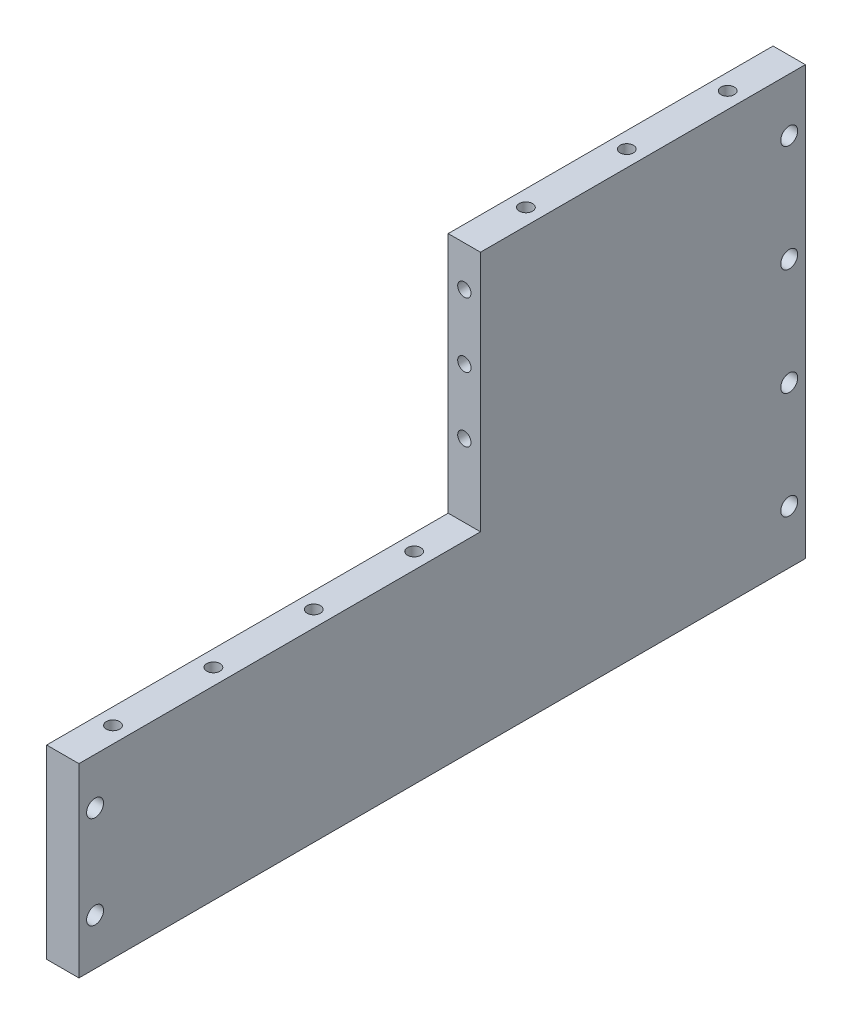
ISO-10303-21;
HEADER;
FILE_DESCRIPTION(('STEP AP214'),'2;1');
FILE_NAME('part.step','',(''),(''),'','','');
FILE_SCHEMA(('AUTOMOTIVE_DESIGN { 1 0 10303 214 1 1 1 1 }'));
ENDSEC;
DATA;
#1=APPLICATION_CONTEXT('core data for automotive mechanical design processes');
#2=APPLICATION_PROTOCOL_DEFINITION('international standard','automotive_design',2000,#1);
#3=PRODUCT_CONTEXT('',#1,'mechanical');
#4=PRODUCT('Part','Part','',(#3));
#5=PRODUCT_RELATED_PRODUCT_CATEGORY('part','',(#4));
#6=PRODUCT_DEFINITION_FORMATION('','',#4);
#7=PRODUCT_DEFINITION_CONTEXT('part definition',#1,'design');
#8=PRODUCT_DEFINITION('design','',#6,#7);
#9=PRODUCT_DEFINITION_SHAPE('','',#8);
#10=(LENGTH_UNIT() NAMED_UNIT(*) SI_UNIT(.MILLI.,.METRE.));
#11=(NAMED_UNIT(*) PLANE_ANGLE_UNIT() SI_UNIT($,.RADIAN.));
#12=(NAMED_UNIT(*) SI_UNIT($,.STERADIAN.) SOLID_ANGLE_UNIT());
#13=UNCERTAINTY_MEASURE_WITH_UNIT(LENGTH_MEASURE(1.E-05),#10,'distance_accuracy_value','');
#14=(GEOMETRIC_REPRESENTATION_CONTEXT(3) GLOBAL_UNCERTAINTY_ASSIGNED_CONTEXT((#13)) GLOBAL_UNIT_ASSIGNED_CONTEXT((#10,
#11,#12)) REPRESENTATION_CONTEXT('',''));
#15=CARTESIAN_POINT('',(0.,0.,0.));
#16=DIRECTION('',(0.,0.,1.));
#17=DIRECTION('',(1.,0.,0.));
#18=AXIS2_PLACEMENT_3D('',#15,#16,#17);
#19=CARTESIAN_POINT('',(-8.,0.,-9.50000000000003));
#20=DIRECTION('',(0.,0.,1.));
#21=DIRECTION('',(0.,-1.,0.));
#22=AXIS2_PLACEMENT_3D('',#19,#20,#21);
#23=PLANE('',#22);
#24=DIRECTION('',(0.,-1.,0.));
#25=VECTOR('',#24,1.);
#26=CARTESIAN_POINT('',(0.,0.,-9.50000000000003));
#27=LINE('',#26,#25);
#28=CARTESIAN_POINT('',(0.,53.,-9.50000000000001));
#29=VERTEX_POINT('',#28);
#30=CARTESIAN_POINT('',(0.,-7.00000000000002,-9.50000000000004));
#31=VERTEX_POINT('',#30);
#32=EDGE_CURVE('E151',#29,#31,#27,.T.);
#33=ORIENTED_EDGE('',*,*,#32,.F.);
#34=DIRECTION('',(1.,0.,0.));
#35=VECTOR('',#34,1.);
#36=CARTESIAN_POINT('',(-8.,53.,-9.50000000000001));
#37=LINE('',#36,#35);
#38=CARTESIAN_POINT('',(-8.,53.,-9.50000000000001));
#39=VERTEX_POINT('',#38);
#40=EDGE_CURVE('E114',#39,#29,#37,.T.);
#41=ORIENTED_EDGE('',*,*,#40,.F.);
#42=DIRECTION('',(0.,-1.,0.));
#43=VECTOR('',#42,1.);
#44=CARTESIAN_POINT('',(-8.,0.,-9.50000000000003));
#45=LINE('',#44,#43);
#46=CARTESIAN_POINT('',(-8.,-7.00000000000002,-9.50000000000004));
#47=VERTEX_POINT('',#46);
#48=EDGE_CURVE('E105',#39,#47,#45,.T.);
#49=ORIENTED_EDGE('',*,*,#48,.T.);
#50=DIRECTION('',(1.,0.,0.));
#51=VECTOR('',#50,1.);
#52=CARTESIAN_POINT('',(-8.,-7.00000000000002,-9.50000000000004));
#53=LINE('',#52,#51);
#54=EDGE_CURVE('E108',#47,#31,#53,.T.);
#55=ORIENTED_EDGE('',*,*,#54,.T.);
#56=EDGE_LOOP('',(#33,#41,#49,#55));
#57=FACE_BOUND('',#56,.T.);
#58=CARTESIAN_POINT('',(-4.,11.,-9.50000000000003));
#59=DIRECTION('',(0.,0.,1.));
#60=DIRECTION('',(1.,0.,0.));
#61=AXIS2_PLACEMENT_3D('',#58,#59,#60);
#62=CIRCLE('',#61,1.65);
#63=CARTESIAN_POINT('',(-2.35,11.,-9.50000000000003));
#64=VERTEX_POINT('',#63);
#65=EDGE_CURVE('E365',#64,#64,#62,.T.);
#66=ORIENTED_EDGE('',*,*,#65,.F.);
#67=EDGE_LOOP('',(#66));
#68=FACE_BOUND('',#67,.T.);
#69=CARTESIAN_POINT('',(-4.,27.,-9.50000000000003));
#70=DIRECTION('',(0.,0.,1.));
#71=DIRECTION('',(1.,0.,0.));
#72=AXIS2_PLACEMENT_3D('',#69,#70,#71);
#73=CIRCLE('',#72,1.65);
#74=CARTESIAN_POINT('',(-2.35,27.,-9.50000000000003));
#75=VERTEX_POINT('',#74);
#76=EDGE_CURVE('E357',#75,#75,#73,.T.);
#77=ORIENTED_EDGE('',*,*,#76,.F.);
#78=EDGE_LOOP('',(#77));
#79=FACE_BOUND('',#78,.T.);
#80=CARTESIAN_POINT('',(-4.,43.,-9.50000000000003));
#81=DIRECTION('',(0.,0.,-1.));
#82=DIRECTION('',(-1.,0.,0.));
#83=AXIS2_PLACEMENT_3D('',#80,#81,#82);
#84=CIRCLE('',#83,1.65);
#85=CARTESIAN_POINT('',(-5.65,43.,-9.50000000000003));
#86=VERTEX_POINT('',#85);
#87=EDGE_CURVE('E351',#86,#86,#84,.T.);
#88=ORIENTED_EDGE('',*,*,#87,.T.);
#89=EDGE_LOOP('',(#88));
#90=FACE_BOUND('',#89,.T.);
#91=ADVANCED_FACE('F40',(#57,#68,#79,#90),#23,.T.);
#92=CARTESIAN_POINT('',(-8.,-53.,0.));
#93=DIRECTION('',(0.,-1.,0.));
#94=DIRECTION('',(0.,0.,-1.));
#95=AXIS2_PLACEMENT_3D('',#92,#93,#94);
#96=PLANE('',#95);
#97=CARTESIAN_POINT('',(-4.,-53.,-4.50000000000003));
#98=DIRECTION('',(0.,1.,0.));
#99=DIRECTION('',(0.,0.,1.));
#100=AXIS2_PLACEMENT_3D('',#97,#98,#99);
#101=CIRCLE('',#100,1.65);
#102=CARTESIAN_POINT('',(-4.,-53.,-2.85000000000003));
#103=VERTEX_POINT('',#102);
#104=EDGE_CURVE('E421',#103,#103,#101,.T.);
#105=ORIENTED_EDGE('',*,*,#104,.T.);
#106=EDGE_LOOP('',(#105));
#107=FACE_BOUND('',#106,.T.);
#108=DIRECTION('',(0.,0.,-1.));
#109=VECTOR('',#108,1.);
#110=CARTESIAN_POINT('',(0.,-53.,0.));
#111=LINE('',#110,#109);
#112=CARTESIAN_POINT('',(0.,-53.,90.));
#113=VERTEX_POINT('',#112);
#114=CARTESIAN_POINT('',(0.,-53.,-90.));
#115=VERTEX_POINT('',#114);
#116=EDGE_CURVE('E142',#113,#115,#111,.T.);
#117=ORIENTED_EDGE('',*,*,#116,.F.);
#118=DIRECTION('',(1.,0.,0.));
#119=VECTOR('',#118,1.);
#120=CARTESIAN_POINT('',(-8.,-53.,90.));
#121=LINE('',#120,#119);
#122=CARTESIAN_POINT('',(-8.,-53.,90.));
#123=VERTEX_POINT('',#122);
#124=EDGE_CURVE('E11',#123,#113,#121,.T.);
#125=ORIENTED_EDGE('',*,*,#124,.F.);
#126=DIRECTION('',(0.,0.,-1.));
#127=VECTOR('',#126,1.);
#128=CARTESIAN_POINT('',(-8.,-53.,0.));
#129=LINE('',#128,#127);
#130=CARTESIAN_POINT('',(-8.,-53.,-90.));
#131=VERTEX_POINT('',#130);
#132=EDGE_CURVE('E174',#123,#131,#129,.T.);
#133=ORIENTED_EDGE('',*,*,#132,.T.);
#134=DIRECTION('',(1.,0.,0.));
#135=VECTOR('',#134,1.);
#136=CARTESIAN_POINT('',(-8.,-53.,-90.));
#137=LINE('',#136,#135);
#138=EDGE_CURVE('E44',#131,#115,#137,.T.);
#139=ORIENTED_EDGE('',*,*,#138,.T.);
#140=EDGE_LOOP('',(#117,#125,#133,#139));
#141=FACE_BOUND('',#140,.T.);
#142=CARTESIAN_POINT('',(-4.,-53.,-45.25));
#143=DIRECTION('',(0.,-1.,0.));
#144=DIRECTION('',(0.,0.,-1.));
#145=AXIS2_PLACEMENT_3D('',#142,#143,#144);
#146=CIRCLE('',#145,1.65);
#147=CARTESIAN_POINT('',(-4.,-53.,-46.9));
#148=VERTEX_POINT('',#147);
#149=EDGE_CURVE('E415',#148,#148,#146,.T.);
#150=ORIENTED_EDGE('',*,*,#149,.F.);
#151=EDGE_LOOP('',(#150));
#152=FACE_BOUND('',#151,.T.);
#153=CARTESIAN_POINT('',(-4.,-53.,-86.));
#154=DIRECTION('',(0.,-1.,0.));
#155=DIRECTION('',(0.,0.,-1.));
#156=AXIS2_PLACEMENT_3D('',#153,#154,#155);
#157=CIRCLE('',#156,1.65);
#158=CARTESIAN_POINT('',(-4.,-53.,-87.65));
#159=VERTEX_POINT('',#158);
#160=EDGE_CURVE('E412',#159,#159,#157,.T.);
#161=ORIENTED_EDGE('',*,*,#160,.F.);
#162=EDGE_LOOP('',(#161));
#163=FACE_BOUND('',#162,.T.);
#164=ADVANCED_FACE('F42',(#107,#141,#152,#163),#96,.T.);
#165=CARTESIAN_POINT('',(-8.,0.,90.));
#166=DIRECTION('',(0.,0.,1.));
#167=DIRECTION('',(1.,0.,0.));
#168=AXIS2_PLACEMENT_3D('',#165,#166,#167);
#169=PLANE('',#168);
#170=DIRECTION('',(0.,-1.,0.));
#171=VECTOR('',#170,1.);
#172=CARTESIAN_POINT('',(0.,0.,90.));
#173=LINE('',#172,#171);
#174=CARTESIAN_POINT('',(0.,-7.00000000000002,90.));
#175=VERTEX_POINT('',#174);
#176=EDGE_CURVE('E154',#175,#113,#173,.T.);
#177=ORIENTED_EDGE('',*,*,#176,.F.);
#178=DIRECTION('',(1.,0.,0.));
#179=VECTOR('',#178,1.);
#180=CARTESIAN_POINT('',(-8.,-7.00000000000002,90.));
#181=LINE('',#180,#179);
#182=CARTESIAN_POINT('',(-8.,-7.00000000000002,90.));
#183=VERTEX_POINT('',#182);
#184=EDGE_CURVE('E50',#183,#175,#181,.T.);
#185=ORIENTED_EDGE('',*,*,#184,.F.);
#186=DIRECTION('',(0.,-1.,0.));
#187=VECTOR('',#186,1.);
#188=CARTESIAN_POINT('',(-8.,0.,90.));
#189=LINE('',#188,#187);
#190=EDGE_CURVE('E106',#183,#123,#189,.T.);
#191=ORIENTED_EDGE('',*,*,#190,.T.);
#192=ORIENTED_EDGE('',*,*,#124,.T.);
#193=EDGE_LOOP('',(#177,#185,#191,#192));
#194=FACE_BOUND('',#193,.T.);
#195=ADVANCED_FACE('F188',(#194),#169,.T.);
#196=CARTESIAN_POINT('',(-8.,-7.00000000000002,0.));
#197=DIRECTION('',(0.,-1.,0.));
#198=DIRECTION('',(0.,0.,-1.));
#199=AXIS2_PLACEMENT_3D('',#196,#197,#198);
#200=PLANE('',#199);
#201=CARTESIAN_POINT('',(-4.,-7.00000000000002,2.93749999999999));
#202=DIRECTION('',(0.,1.,0.));
#203=DIRECTION('',(0.,0.,1.));
#204=AXIS2_PLACEMENT_3D('',#201,#202,#203);
#205=CIRCLE('',#204,1.65);
#206=CARTESIAN_POINT('',(-4.,-7.00000000000002,4.58749999999999));
#207=VERTEX_POINT('',#206);
#208=EDGE_CURVE('E375',#207,#207,#205,.T.);
#209=ORIENTED_EDGE('',*,*,#208,.F.);
#210=EDGE_LOOP('',(#209));
#211=FACE_BOUND('',#210,.T.);
#212=CARTESIAN_POINT('',(-4.,-7.00000000000002,27.8125));
#213=DIRECTION('',(0.,1.,0.));
#214=DIRECTION('',(0.,0.,1.));
#215=AXIS2_PLACEMENT_3D('',#212,#213,#214);
#216=CIRCLE('',#215,1.65);
#217=CARTESIAN_POINT('',(-4.,-7.00000000000002,29.4625));
#218=VERTEX_POINT('',#217);
#219=EDGE_CURVE('E378',#218,#218,#216,.T.);
#220=ORIENTED_EDGE('',*,*,#219,.F.);
#221=EDGE_LOOP('',(#220));
#222=FACE_BOUND('',#221,.T.);
#223=CARTESIAN_POINT('',(-4.,-7.00000000000002,52.6875));
#224=DIRECTION('',(0.,1.,0.));
#225=DIRECTION('',(0.,0.,-1.));
#226=AXIS2_PLACEMENT_3D('',#223,#224,#225);
#227=CIRCLE('',#226,1.65);
#228=CARTESIAN_POINT('',(-4.,-7.00000000000002,51.0375));
#229=VERTEX_POINT('',#228);
#230=EDGE_CURVE('E384',#229,#229,#227,.T.);
#231=ORIENTED_EDGE('',*,*,#230,.F.);
#232=EDGE_LOOP('',(#231));
#233=FACE_BOUND('',#232,.T.);
#234=CARTESIAN_POINT('',(-4.,-7.00000000000002,77.5625));
#235=DIRECTION('',(0.,1.,0.));
#236=DIRECTION('',(0.,0.,-1.));
#237=AXIS2_PLACEMENT_3D('',#234,#235,#236);
#238=CIRCLE('',#237,1.65);
#239=CARTESIAN_POINT('',(-4.,-7.00000000000002,75.9125));
#240=VERTEX_POINT('',#239);
#241=EDGE_CURVE('E354',#240,#240,#238,.T.);
#242=ORIENTED_EDGE('',*,*,#241,.F.);
#243=EDGE_LOOP('',(#242));
#244=FACE_BOUND('',#243,.T.);
#245=DIRECTION('',(0.,0.,-1.));
#246=VECTOR('',#245,1.);
#247=CARTESIAN_POINT('',(0.,-7.00000000000002,0.));
#248=LINE('',#247,#246);
#249=EDGE_CURVE('E110',#175,#31,#248,.T.);
#250=ORIENTED_EDGE('',*,*,#249,.T.);
#251=ORIENTED_EDGE('',*,*,#54,.F.);
#252=DIRECTION('',(0.,0.,-1.));
#253=VECTOR('',#252,1.);
#254=CARTESIAN_POINT('',(-8.,-7.00000000000002,0.));
#255=LINE('',#254,#253);
#256=EDGE_CURVE('E100',#183,#47,#255,.T.);
#257=ORIENTED_EDGE('',*,*,#256,.F.);
#258=ORIENTED_EDGE('',*,*,#184,.T.);
#259=EDGE_LOOP('',(#250,#251,#257,#258));
#260=FACE_BOUND('',#259,.T.);
#261=ADVANCED_FACE('F109',(#211,#222,#233,#244,#260),#200,.F.);
#262=CARTESIAN_POINT('',(-8.,53.,0.));
#263=DIRECTION('',(0.,-1.,0.));
#264=DIRECTION('',(0.,0.,-1.));
#265=AXIS2_PLACEMENT_3D('',#262,#263,#264);
#266=PLANE('',#265);
#267=CARTESIAN_POINT('',(-4.,53.,-24.75));
#268=DIRECTION('',(0.,1.,0.));
#269=DIRECTION('',(0.,0.,-1.));
#270=AXIS2_PLACEMENT_3D('',#267,#268,#269);
#271=CIRCLE('',#270,1.65);
#272=CARTESIAN_POINT('',(-4.,53.,-26.4));
#273=VERTEX_POINT('',#272);
#274=EDGE_CURVE('E399',#273,#273,#271,.T.);
#275=ORIENTED_EDGE('',*,*,#274,.F.);
#276=EDGE_LOOP('',(#275));
#277=FACE_BOUND('',#276,.T.);
#278=CARTESIAN_POINT('',(-4.,53.,-74.75));
#279=DIRECTION('',(0.,1.,0.));
#280=DIRECTION('',(0.,0.,1.));
#281=AXIS2_PLACEMENT_3D('',#278,#279,#280);
#282=CIRCLE('',#281,1.65);
#283=CARTESIAN_POINT('',(-4.,53.,-73.1));
#284=VERTEX_POINT('',#283);
#285=EDGE_CURVE('E392',#284,#284,#282,.T.);
#286=ORIENTED_EDGE('',*,*,#285,.F.);
#287=EDGE_LOOP('',(#286));
#288=FACE_BOUND('',#287,.T.);
#289=CARTESIAN_POINT('',(-4.,53.,-49.75));
#290=DIRECTION('',(0.,1.,0.));
#291=DIRECTION('',(0.,0.,1.));
#292=AXIS2_PLACEMENT_3D('',#289,#290,#291);
#293=CIRCLE('',#292,1.65);
#294=CARTESIAN_POINT('',(-4.,53.,-48.1));
#295=VERTEX_POINT('',#294);
#296=EDGE_CURVE('E395',#295,#295,#293,.T.);
#297=ORIENTED_EDGE('',*,*,#296,.F.);
#298=EDGE_LOOP('',(#297));
#299=FACE_BOUND('',#298,.T.);
#300=DIRECTION('',(0.,0.,-1.));
#301=VECTOR('',#300,1.);
#302=CARTESIAN_POINT('',(0.,53.,0.));
#303=LINE('',#302,#301);
#304=CARTESIAN_POINT('',(0.,53.,-90.));
#305=VERTEX_POINT('',#304);
#306=EDGE_CURVE('E149',#29,#305,#303,.T.);
#307=ORIENTED_EDGE('',*,*,#306,.T.);
#308=DIRECTION('',(1.,0.,0.));
#309=VECTOR('',#308,1.);
#310=CARTESIAN_POINT('',(-8.,53.,-90.));
#311=LINE('',#310,#309);
#312=CARTESIAN_POINT('',(-8.,53.,-90.));
#313=VERTEX_POINT('',#312);
#314=EDGE_CURVE('E177',#313,#305,#311,.T.);
#315=ORIENTED_EDGE('',*,*,#314,.F.);
#316=DIRECTION('',(0.,0.,-1.));
#317=VECTOR('',#316,1.);
#318=CARTESIAN_POINT('',(-8.,53.,0.));
#319=LINE('',#318,#317);
#320=EDGE_CURVE('E118',#39,#313,#319,.T.);
#321=ORIENTED_EDGE('',*,*,#320,.F.);
#322=ORIENTED_EDGE('',*,*,#40,.T.);
#323=EDGE_LOOP('',(#307,#315,#321,#322));
#324=FACE_BOUND('',#323,.T.);
#325=ADVANCED_FACE('F195',(#277,#288,#299,#324),#266,.F.);
#326=CARTESIAN_POINT('',(-8.,39.75,-85.9999999999998));
#327=DIRECTION('',(1.,0.,0.));
#328=DIRECTION('',(0.,0.,-1.));
#329=AXIS2_PLACEMENT_3D('',#326,#327,#328);
#330=CYLINDRICAL_SURFACE('',#329,2.1);
#331=CARTESIAN_POINT('',(-8.,39.75,-85.9999999999998));
#332=DIRECTION('',(1.,0.,0.));
#333=DIRECTION('',(0.,0.,-1.));
#334=AXIS2_PLACEMENT_3D('',#331,#332,#333);
#335=CIRCLE('',#334,2.1);
#336=CARTESIAN_POINT('',(-8.,39.75,-88.0999999999998));
#337=VERTEX_POINT('',#336);
#338=EDGE_CURVE('E136',#337,#337,#335,.T.);
#339=ORIENTED_EDGE('',*,*,#338,.F.);
#340=EDGE_LOOP('',(#339));
#341=FACE_BOUND('',#340,.T.);
#342=CARTESIAN_POINT('',(0.,39.75,-85.9999999999998));
#343=DIRECTION('',(1.,0.,0.));
#344=DIRECTION('',(0.,0.,-1.));
#345=AXIS2_PLACEMENT_3D('',#342,#343,#344);
#346=CIRCLE('',#345,2.1);
#347=CARTESIAN_POINT('',(0.,39.75,-88.0999999999998));
#348=VERTEX_POINT('',#347);
#349=EDGE_CURVE('E169',#348,#348,#346,.T.);
#350=ORIENTED_EDGE('',*,*,#349,.T.);
#351=EDGE_LOOP('',(#350));
#352=FACE_BOUND('',#351,.T.);
#353=ADVANCED_FACE('F206',(#341,#352),#330,.F.);
#354=CARTESIAN_POINT('',(-8.,13.25,-85.9999999999998));
#355=DIRECTION('',(1.,0.,0.));
#356=DIRECTION('',(0.,0.,-1.));
#357=AXIS2_PLACEMENT_3D('',#354,#355,#356);
#358=CYLINDRICAL_SURFACE('',#357,2.1);
#359=CARTESIAN_POINT('',(-8.,13.25,-85.9999999999998));
#360=DIRECTION('',(1.,0.,0.));
#361=DIRECTION('',(0.,0.,-1.));
#362=AXIS2_PLACEMENT_3D('',#359,#360,#361);
#363=CIRCLE('',#362,2.1);
#364=CARTESIAN_POINT('',(-8.,13.25,-88.0999999999998));
#365=VERTEX_POINT('',#364);
#366=EDGE_CURVE('E133',#365,#365,#363,.T.);
#367=ORIENTED_EDGE('',*,*,#366,.F.);
#368=EDGE_LOOP('',(#367));
#369=FACE_BOUND('',#368,.T.);
#370=CARTESIAN_POINT('',(0.,13.25,-85.9999999999998));
#371=DIRECTION('',(1.,0.,0.));
#372=DIRECTION('',(0.,0.,-1.));
#373=AXIS2_PLACEMENT_3D('',#370,#371,#372);
#374=CIRCLE('',#373,2.1);
#375=CARTESIAN_POINT('',(0.,13.25,-88.0999999999998));
#376=VERTEX_POINT('',#375);
#377=EDGE_CURVE('E166',#376,#376,#374,.T.);
#378=ORIENTED_EDGE('',*,*,#377,.T.);
#379=EDGE_LOOP('',(#378));
#380=FACE_BOUND('',#379,.T.);
#381=ADVANCED_FACE('F230',(#369,#380),#358,.F.);
#382=CARTESIAN_POINT('',(-8.,-13.25,-85.9999999999998));
#383=DIRECTION('',(1.,0.,0.));
#384=DIRECTION('',(0.,0.,-1.));
#385=AXIS2_PLACEMENT_3D('',#382,#383,#384);
#386=CYLINDRICAL_SURFACE('',#385,2.1);
#387=CARTESIAN_POINT('',(-8.,-13.25,-85.9999999999998));
#388=DIRECTION('',(1.,0.,0.));
#389=DIRECTION('',(0.,0.,-1.));
#390=AXIS2_PLACEMENT_3D('',#387,#388,#389);
#391=CIRCLE('',#390,2.1);
#392=CARTESIAN_POINT('',(-8.,-13.25,-88.0999999999998));
#393=VERTEX_POINT('',#392);
#394=EDGE_CURVE('E130',#393,#393,#391,.F.);
#395=ORIENTED_EDGE('',*,*,#394,.T.);
#396=EDGE_LOOP('',(#395));
#397=FACE_BOUND('',#396,.T.);
#398=CARTESIAN_POINT('',(0.,-13.25,-85.9999999999998));
#399=DIRECTION('',(1.,0.,0.));
#400=DIRECTION('',(0.,0.,-1.));
#401=AXIS2_PLACEMENT_3D('',#398,#399,#400);
#402=CIRCLE('',#401,2.1);
#403=CARTESIAN_POINT('',(0.,-13.25,-88.0999999999998));
#404=VERTEX_POINT('',#403);
#405=EDGE_CURVE('E163',#404,#404,#402,.F.);
#406=ORIENTED_EDGE('',*,*,#405,.F.);
#407=EDGE_LOOP('',(#406));
#408=FACE_BOUND('',#407,.T.);
#409=ADVANCED_FACE('F222',(#397,#408),#386,.F.);
#410=CARTESIAN_POINT('',(-8.,-41.5,86.));
#411=DIRECTION('',(1.,0.,0.));
#412=DIRECTION('',(0.,0.,-1.));
#413=AXIS2_PLACEMENT_3D('',#410,#411,#412);
#414=CYLINDRICAL_SURFACE('',#413,2.1);
#415=CARTESIAN_POINT('',(-8.,-41.5,86.));
#416=DIRECTION('',(1.,0.,0.));
#417=DIRECTION('',(0.,0.,-1.));
#418=AXIS2_PLACEMENT_3D('',#415,#416,#417);
#419=CIRCLE('',#418,2.1);
#420=CARTESIAN_POINT('',(-8.,-41.5,83.9));
#421=VERTEX_POINT('',#420);
#422=EDGE_CURVE('E127',#421,#421,#419,.F.);
#423=ORIENTED_EDGE('',*,*,#422,.T.);
#424=EDGE_LOOP('',(#423));
#425=FACE_BOUND('',#424,.T.);
#426=CARTESIAN_POINT('',(0.,-41.5,86.));
#427=DIRECTION('',(1.,0.,0.));
#428=DIRECTION('',(0.,0.,-1.));
#429=AXIS2_PLACEMENT_3D('',#426,#427,#428);
#430=CIRCLE('',#429,2.1);
#431=CARTESIAN_POINT('',(0.,-41.5,83.9));
#432=VERTEX_POINT('',#431);
#433=EDGE_CURVE('E160',#432,#432,#430,.F.);
#434=ORIENTED_EDGE('',*,*,#433,.F.);
#435=EDGE_LOOP('',(#434));
#436=FACE_BOUND('',#435,.T.);
#437=ADVANCED_FACE('F217',(#425,#436),#414,.F.);
#438=CARTESIAN_POINT('',(-8.,-18.5,86.));
#439=DIRECTION('',(1.,0.,0.));
#440=DIRECTION('',(0.,0.,-1.));
#441=AXIS2_PLACEMENT_3D('',#438,#439,#440);
#442=CYLINDRICAL_SURFACE('',#441,2.1);
#443=CARTESIAN_POINT('',(-8.,-18.5,86.));
#444=DIRECTION('',(1.,0.,0.));
#445=DIRECTION('',(0.,0.,-1.));
#446=AXIS2_PLACEMENT_3D('',#443,#444,#445);
#447=CIRCLE('',#446,2.1);
#448=CARTESIAN_POINT('',(-8.,-18.5,83.9));
#449=VERTEX_POINT('',#448);
#450=EDGE_CURVE('E124',#449,#449,#447,.T.);
#451=ORIENTED_EDGE('',*,*,#450,.F.);
#452=EDGE_LOOP('',(#451));
#453=FACE_BOUND('',#452,.T.);
#454=CARTESIAN_POINT('',(0.,-18.5,86.));
#455=DIRECTION('',(1.,0.,0.));
#456=DIRECTION('',(0.,0.,-1.));
#457=AXIS2_PLACEMENT_3D('',#454,#455,#456);
#458=CIRCLE('',#457,2.1);
#459=CARTESIAN_POINT('',(0.,-18.5,83.9));
#460=VERTEX_POINT('',#459);
#461=EDGE_CURVE('E157',#460,#460,#458,.T.);
#462=ORIENTED_EDGE('',*,*,#461,.T.);
#463=EDGE_LOOP('',(#462));
#464=FACE_BOUND('',#463,.T.);
#465=ADVANCED_FACE('F210',(#453,#464),#442,.F.);
#466=CARTESIAN_POINT('',(-8.,0.,-90.));
#467=DIRECTION('',(0.,0.,1.));
#468=DIRECTION('',(1.,0.,0.));
#469=AXIS2_PLACEMENT_3D('',#466,#467,#468);
#470=PLANE('',#469);
#471=DIRECTION('',(0.,-1.,0.));
#472=VECTOR('',#471,1.);
#473=CARTESIAN_POINT('',(0.,0.,-90.));
#474=LINE('',#473,#472);
#475=EDGE_CURVE('E145',#305,#115,#474,.T.);
#476=ORIENTED_EDGE('',*,*,#475,.T.);
#477=ORIENTED_EDGE('',*,*,#138,.F.);
#478=DIRECTION('',(0.,-1.,0.));
#479=VECTOR('',#478,1.);
#480=CARTESIAN_POINT('',(-8.,0.,-90.));
#481=LINE('',#480,#479);
#482=EDGE_CURVE('E91',#313,#131,#481,.T.);
#483=ORIENTED_EDGE('',*,*,#482,.F.);
#484=ORIENTED_EDGE('',*,*,#314,.T.);
#485=EDGE_LOOP('',(#476,#477,#483,#484));
#486=FACE_BOUND('',#485,.T.);
#487=ADVANCED_FACE('F183',(#486),#470,.F.);
#488=CARTESIAN_POINT('',(-8.,-39.75,-85.9999999999998));
#489=DIRECTION('',(1.,0.,0.));
#490=DIRECTION('',(0.,0.,-1.));
#491=AXIS2_PLACEMENT_3D('',#488,#489,#490);
#492=CYLINDRICAL_SURFACE('',#491,2.1);
#493=CARTESIAN_POINT('',(-8.,-39.75,-85.9999999999998));
#494=DIRECTION('',(1.,0.,0.));
#495=DIRECTION('',(0.,0.,-1.));
#496=AXIS2_PLACEMENT_3D('',#493,#494,#495);
#497=CIRCLE('',#496,2.1);
#498=CARTESIAN_POINT('',(-8.,-39.75,-88.0999999999998));
#499=VERTEX_POINT('',#498);
#500=EDGE_CURVE('E139',#499,#499,#497,.F.);
#501=ORIENTED_EDGE('',*,*,#500,.T.);
#502=EDGE_LOOP('',(#501));
#503=FACE_BOUND('',#502,.T.);
#504=CARTESIAN_POINT('',(0.,-39.75,-85.9999999999998));
#505=DIRECTION('',(1.,0.,0.));
#506=DIRECTION('',(0.,0.,-1.));
#507=AXIS2_PLACEMENT_3D('',#504,#505,#506);
#508=CIRCLE('',#507,2.1);
#509=CARTESIAN_POINT('',(0.,-39.75,-88.0999999999998));
#510=VERTEX_POINT('',#509);
#511=EDGE_CURVE('E172',#510,#510,#508,.F.);
#512=ORIENTED_EDGE('',*,*,#511,.F.);
#513=EDGE_LOOP('',(#512));
#514=FACE_BOUND('',#513,.T.);
#515=ADVANCED_FACE('F209',(#503,#514),#492,.F.);
#516=CARTESIAN_POINT('',(-8.,0.,0.));
#517=DIRECTION('',(1.,0.,0.));
#518=DIRECTION('',(0.,0.,-1.));
#519=AXIS2_PLACEMENT_3D('',#516,#517,#518);
#520=PLANE('',#519);
#521=ORIENTED_EDGE('',*,*,#132,.F.);
#522=ORIENTED_EDGE('',*,*,#190,.F.);
#523=ORIENTED_EDGE('',*,*,#256,.T.);
#524=ORIENTED_EDGE('',*,*,#48,.F.);
#525=ORIENTED_EDGE('',*,*,#320,.T.);
#526=ORIENTED_EDGE('',*,*,#482,.T.);
#527=EDGE_LOOP('',(#521,#522,#523,#524,#525,#526));
#528=FACE_BOUND('',#527,.T.);
#529=ORIENTED_EDGE('',*,*,#450,.T.);
#530=EDGE_LOOP('',(#529));
#531=FACE_BOUND('',#530,.T.);
#532=ORIENTED_EDGE('',*,*,#422,.F.);
#533=EDGE_LOOP('',(#532));
#534=FACE_BOUND('',#533,.T.);
#535=ORIENTED_EDGE('',*,*,#394,.F.);
#536=EDGE_LOOP('',(#535));
#537=FACE_BOUND('',#536,.T.);
#538=ORIENTED_EDGE('',*,*,#366,.T.);
#539=EDGE_LOOP('',(#538));
#540=FACE_BOUND('',#539,.T.);
#541=ORIENTED_EDGE('',*,*,#338,.T.);
#542=EDGE_LOOP('',(#541));
#543=FACE_BOUND('',#542,.T.);
#544=ORIENTED_EDGE('',*,*,#500,.F.);
#545=EDGE_LOOP('',(#544));
#546=FACE_BOUND('',#545,.T.);
#547=ADVANCED_FACE('F102',(#528,#531,#534,#537,#540,#543,#546),#520,.F.);
#548=CARTESIAN_POINT('',(0.,0.,0.));
#549=DIRECTION('',(1.,0.,0.));
#550=DIRECTION('',(0.,0.,-1.));
#551=AXIS2_PLACEMENT_3D('',#548,#549,#550);
#552=PLANE('',#551);
#553=ORIENTED_EDGE('',*,*,#116,.T.);
#554=ORIENTED_EDGE('',*,*,#475,.F.);
#555=ORIENTED_EDGE('',*,*,#306,.F.);
#556=ORIENTED_EDGE('',*,*,#32,.T.);
#557=ORIENTED_EDGE('',*,*,#249,.F.);
#558=ORIENTED_EDGE('',*,*,#176,.T.);
#559=EDGE_LOOP('',(#553,#554,#555,#556,#557,#558));
#560=FACE_BOUND('',#559,.T.);
#561=ORIENTED_EDGE('',*,*,#461,.F.);
#562=EDGE_LOOP('',(#561));
#563=FACE_BOUND('',#562,.T.);
#564=ORIENTED_EDGE('',*,*,#433,.T.);
#565=EDGE_LOOP('',(#564));
#566=FACE_BOUND('',#565,.T.);
#567=ORIENTED_EDGE('',*,*,#405,.T.);
#568=EDGE_LOOP('',(#567));
#569=FACE_BOUND('',#568,.T.);
#570=ORIENTED_EDGE('',*,*,#377,.F.);
#571=EDGE_LOOP('',(#570));
#572=FACE_BOUND('',#571,.T.);
#573=ORIENTED_EDGE('',*,*,#349,.F.);
#574=EDGE_LOOP('',(#573));
#575=FACE_BOUND('',#574,.T.);
#576=ORIENTED_EDGE('',*,*,#511,.T.);
#577=EDGE_LOOP('',(#576));
#578=FACE_BOUND('',#577,.T.);
#579=ADVANCED_FACE('F186',(#560,#563,#566,#569,#572,#575,#578),#552,.T.);
#580=CARTESIAN_POINT('',(-4.,-48.,-4.50000000000003));
#581=DIRECTION('',(0.,-1.,0.));
#582=DIRECTION('',(0.,0.,-1.));
#583=AXIS2_PLACEMENT_3D('',#580,#581,#582);
#584=CYLINDRICAL_SURFACE('',#583,1.65);
#585=CARTESIAN_POINT('',(-4.,-48.,-4.50000000000003));
#586=DIRECTION('',(0.,1.,0.));
#587=DIRECTION('',(0.,0.,1.));
#588=AXIS2_PLACEMENT_3D('',#585,#586,#587);
#589=CIRCLE('',#588,1.65);
#590=CARTESIAN_POINT('',(-4.,-48.,-2.85000000000003));
#591=VERTEX_POINT('',#590);
#592=EDGE_CURVE('E407',#591,#591,#589,.T.);
#593=ORIENTED_EDGE('',*,*,#592,.T.);
#594=EDGE_LOOP('',(#593));
#595=FACE_BOUND('',#594,.T.);
#596=ORIENTED_EDGE('',*,*,#104,.F.);
#597=EDGE_LOOP('',(#596));
#598=FACE_BOUND('',#597,.T.);
#599=ADVANCED_FACE('F240',(#595,#598),#584,.F.);
#600=CARTESIAN_POINT('',(-4.,-48.,-4.50000000000003));
#601=DIRECTION('',(0.,1.,0.));
#602=DIRECTION('',(0.,0.,1.));
#603=AXIS2_PLACEMENT_3D('',#600,#601,#602);
#604=PLANE('',#603);
#605=ORIENTED_EDGE('',*,*,#592,.F.);
#606=EDGE_LOOP('',(#605));
#607=FACE_BOUND('',#606,.T.);
#608=ADVANCED_FACE('F243',(#607),#604,.F.);
#609=CARTESIAN_POINT('',(-4.,-48.,-45.25));
#610=DIRECTION('',(0.,-1.,0.));
#611=DIRECTION('',(0.,0.,-1.));
#612=AXIS2_PLACEMENT_3D('',#609,#610,#611);
#613=CYLINDRICAL_SURFACE('',#612,1.65);
#614=CARTESIAN_POINT('',(-4.,-48.,-45.25));
#615=DIRECTION('',(0.,-1.,0.));
#616=DIRECTION('',(0.,0.,-1.));
#617=AXIS2_PLACEMENT_3D('',#614,#615,#616);
#618=CIRCLE('',#617,1.65);
#619=CARTESIAN_POINT('',(-4.,-48.,-46.9));
#620=VERTEX_POINT('',#619);
#621=EDGE_CURVE('E418',#620,#620,#618,.T.);
#622=ORIENTED_EDGE('',*,*,#621,.F.);
#623=EDGE_LOOP('',(#622));
#624=FACE_BOUND('',#623,.T.);
#625=ORIENTED_EDGE('',*,*,#149,.T.);
#626=EDGE_LOOP('',(#625));
#627=FACE_BOUND('',#626,.T.);
#628=ADVANCED_FACE('F246',(#624,#627),#613,.F.);
#629=CARTESIAN_POINT('',(-4.,-48.,-45.25));
#630=DIRECTION('',(0.,-1.,0.));
#631=DIRECTION('',(0.,0.,-1.));
#632=AXIS2_PLACEMENT_3D('',#629,#630,#631);
#633=PLANE('',#632);
#634=ORIENTED_EDGE('',*,*,#621,.T.);
#635=EDGE_LOOP('',(#634));
#636=FACE_BOUND('',#635,.T.);
#637=ADVANCED_FACE('F251',(#636),#633,.T.);
#638=CARTESIAN_POINT('',(-4.,-48.,-86.));
#639=DIRECTION('',(0.,-1.,0.));
#640=DIRECTION('',(0.,0.,-1.));
#641=AXIS2_PLACEMENT_3D('',#638,#639,#640);
#642=CYLINDRICAL_SURFACE('',#641,1.65);
#643=CARTESIAN_POINT('',(-4.,-48.,-86.));
#644=DIRECTION('',(0.,-1.,0.));
#645=DIRECTION('',(0.,0.,-1.));
#646=AXIS2_PLACEMENT_3D('',#643,#644,#645);
#647=CIRCLE('',#646,1.65);
#648=CARTESIAN_POINT('',(-4.,-48.,-87.65));
#649=VERTEX_POINT('',#648);
#650=EDGE_CURVE('E146',#649,#649,#647,.T.);
#651=ORIENTED_EDGE('',*,*,#650,.F.);
#652=EDGE_LOOP('',(#651));
#653=FACE_BOUND('',#652,.T.);
#654=ORIENTED_EDGE('',*,*,#160,.T.);
#655=EDGE_LOOP('',(#654));
#656=FACE_BOUND('',#655,.T.);
#657=ADVANCED_FACE('F254',(#653,#656),#642,.F.);
#658=CARTESIAN_POINT('',(-4.,-48.,-86.));
#659=DIRECTION('',(0.,-1.,0.));
#660=DIRECTION('',(0.,0.,-1.));
#661=AXIS2_PLACEMENT_3D('',#658,#659,#660);
#662=PLANE('',#661);
#663=ORIENTED_EDGE('',*,*,#650,.T.);
#664=EDGE_LOOP('',(#663));
#665=FACE_BOUND('',#664,.T.);
#666=ADVANCED_FACE('F261',(#665),#662,.T.);
#667=CARTESIAN_POINT('',(-4.,43.,-49.75));
#668=DIRECTION('',(0.,1.,0.));
#669=DIRECTION('',(0.,0.,1.));
#670=AXIS2_PLACEMENT_3D('',#667,#668,#669);
#671=CYLINDRICAL_SURFACE('',#670,1.65);
#672=CARTESIAN_POINT('',(-4.,43.,-49.75));
#673=DIRECTION('',(0.,1.,0.));
#674=DIRECTION('',(0.,0.,1.));
#675=AXIS2_PLACEMENT_3D('',#672,#673,#674);
#676=CIRCLE('',#675,1.65);
#677=CARTESIAN_POINT('',(-4.,43.,-48.1));
#678=VERTEX_POINT('',#677);
#679=EDGE_CURVE('E404',#678,#678,#676,.T.);
#680=ORIENTED_EDGE('',*,*,#679,.F.);
#681=EDGE_LOOP('',(#680));
#682=FACE_BOUND('',#681,.T.);
#683=ORIENTED_EDGE('',*,*,#296,.T.);
#684=EDGE_LOOP('',(#683));
#685=FACE_BOUND('',#684,.T.);
#686=ADVANCED_FACE('F265',(#682,#685),#671,.F.);
#687=CARTESIAN_POINT('',(-4.,43.,-49.75));
#688=DIRECTION('',(0.,1.,0.));
#689=DIRECTION('',(0.,0.,1.));
#690=AXIS2_PLACEMENT_3D('',#687,#688,#689);
#691=PLANE('',#690);
#692=ORIENTED_EDGE('',*,*,#679,.T.);
#693=EDGE_LOOP('',(#692));
#694=FACE_BOUND('',#693,.T.);
#695=ADVANCED_FACE('F269',(#694),#691,.T.);
#696=CARTESIAN_POINT('',(-4.,43.,-74.75));
#697=DIRECTION('',(0.,1.,0.));
#698=DIRECTION('',(0.,0.,1.));
#699=AXIS2_PLACEMENT_3D('',#696,#697,#698);
#700=CYLINDRICAL_SURFACE('',#699,1.65);
#701=CARTESIAN_POINT('',(-4.,43.,-74.75));
#702=DIRECTION('',(0.,1.,0.));
#703=DIRECTION('',(0.,0.,1.));
#704=AXIS2_PLACEMENT_3D('',#701,#702,#703);
#705=CIRCLE('',#704,1.65);
#706=CARTESIAN_POINT('',(-4.,43.,-73.1));
#707=VERTEX_POINT('',#706);
#708=EDGE_CURVE('E396',#707,#707,#705,.T.);
#709=ORIENTED_EDGE('',*,*,#708,.F.);
#710=EDGE_LOOP('',(#709));
#711=FACE_BOUND('',#710,.T.);
#712=ORIENTED_EDGE('',*,*,#285,.T.);
#713=EDGE_LOOP('',(#712));
#714=FACE_BOUND('',#713,.T.);
#715=ADVANCED_FACE('F273',(#711,#714),#700,.F.);
#716=CARTESIAN_POINT('',(-4.,43.,-74.75));
#717=DIRECTION('',(0.,1.,0.));
#718=DIRECTION('',(0.,0.,1.));
#719=AXIS2_PLACEMENT_3D('',#716,#717,#718);
#720=PLANE('',#719);
#721=ORIENTED_EDGE('',*,*,#708,.T.);
#722=EDGE_LOOP('',(#721));
#723=FACE_BOUND('',#722,.T.);
#724=ADVANCED_FACE('F283',(#723),#720,.T.);
#725=CARTESIAN_POINT('',(-4.,43.,-24.75));
#726=DIRECTION('',(0.,1.,0.));
#727=DIRECTION('',(0.,0.,1.));
#728=AXIS2_PLACEMENT_3D('',#725,#726,#727);
#729=CYLINDRICAL_SURFACE('',#728,1.65);
#730=CARTESIAN_POINT('',(-4.,43.,-24.75));
#731=DIRECTION('',(0.,1.,0.));
#732=DIRECTION('',(0.,0.,-1.));
#733=AXIS2_PLACEMENT_3D('',#730,#731,#732);
#734=CIRCLE('',#733,1.65);
#735=CARTESIAN_POINT('',(-4.,43.,-26.4));
#736=VERTEX_POINT('',#735);
#737=EDGE_CURVE('E374',#736,#736,#734,.T.);
#738=ORIENTED_EDGE('',*,*,#737,.F.);
#739=EDGE_LOOP('',(#738));
#740=FACE_BOUND('',#739,.T.);
#741=ORIENTED_EDGE('',*,*,#274,.T.);
#742=EDGE_LOOP('',(#741));
#743=FACE_BOUND('',#742,.T.);
#744=ADVANCED_FACE('F279',(#740,#743),#729,.F.);
#745=CARTESIAN_POINT('',(-4.,43.,-24.75));
#746=DIRECTION('',(0.,-1.,0.));
#747=DIRECTION('',(0.,0.,-1.));
#748=AXIS2_PLACEMENT_3D('',#745,#746,#747);
#749=PLANE('',#748);
#750=ORIENTED_EDGE('',*,*,#737,.T.);
#751=EDGE_LOOP('',(#750));
#752=FACE_BOUND('',#751,.T.);
#753=ADVANCED_FACE('F275',(#752),#749,.F.);
#754=CARTESIAN_POINT('',(-4.,-17.,77.5625));
#755=DIRECTION('',(0.,1.,0.));
#756=DIRECTION('',(0.,0.,1.));
#757=AXIS2_PLACEMENT_3D('',#754,#755,#756);
#758=CYLINDRICAL_SURFACE('',#757,1.65);
#759=CARTESIAN_POINT('',(-4.,-17.,77.5625));
#760=DIRECTION('',(0.,1.,0.));
#761=DIRECTION('',(0.,0.,-1.));
#762=AXIS2_PLACEMENT_3D('',#759,#760,#761);
#763=CIRCLE('',#762,1.65);
#764=CARTESIAN_POINT('',(-4.,-17.,75.9125));
#765=VERTEX_POINT('',#764);
#766=EDGE_CURVE('E350',#765,#765,#763,.T.);
#767=ORIENTED_EDGE('',*,*,#766,.F.);
#768=EDGE_LOOP('',(#767));
#769=FACE_BOUND('',#768,.T.);
#770=ORIENTED_EDGE('',*,*,#241,.T.);
#771=EDGE_LOOP('',(#770));
#772=FACE_BOUND('',#771,.T.);
#773=ADVANCED_FACE('F278',(#769,#772),#758,.F.);
#774=CARTESIAN_POINT('',(-4.,-17.,77.5625));
#775=DIRECTION('',(0.,-1.,0.));
#776=DIRECTION('',(0.,0.,-1.));
#777=AXIS2_PLACEMENT_3D('',#774,#775,#776);
#778=PLANE('',#777);
#779=ORIENTED_EDGE('',*,*,#766,.T.);
#780=EDGE_LOOP('',(#779));
#781=FACE_BOUND('',#780,.T.);
#782=ADVANCED_FACE('F291',(#781),#778,.F.);
#783=CARTESIAN_POINT('',(-4.,-17.,52.6875));
#784=DIRECTION('',(0.,1.,0.));
#785=DIRECTION('',(0.,0.,1.));
#786=AXIS2_PLACEMENT_3D('',#783,#784,#785);
#787=CYLINDRICAL_SURFACE('',#786,1.65);
#788=CARTESIAN_POINT('',(-4.,-17.,52.6875));
#789=DIRECTION('',(0.,1.,0.));
#790=DIRECTION('',(0.,0.,-1.));
#791=AXIS2_PLACEMENT_3D('',#788,#789,#790);
#792=CIRCLE('',#791,1.65);
#793=CARTESIAN_POINT('',(-4.,-17.,51.0375));
#794=VERTEX_POINT('',#793);
#795=EDGE_CURVE('E387',#794,#794,#792,.T.);
#796=ORIENTED_EDGE('',*,*,#795,.F.);
#797=EDGE_LOOP('',(#796));
#798=FACE_BOUND('',#797,.T.);
#799=ORIENTED_EDGE('',*,*,#230,.T.);
#800=EDGE_LOOP('',(#799));
#801=FACE_BOUND('',#800,.T.);
#802=ADVANCED_FACE('F294',(#798,#801),#787,.F.);
#803=CARTESIAN_POINT('',(-4.,-17.,52.6875));
#804=DIRECTION('',(0.,-1.,0.));
#805=DIRECTION('',(0.,0.,-1.));
#806=AXIS2_PLACEMENT_3D('',#803,#804,#805);
#807=PLANE('',#806);
#808=ORIENTED_EDGE('',*,*,#795,.T.);
#809=EDGE_LOOP('',(#808));
#810=FACE_BOUND('',#809,.T.);
#811=ADVANCED_FACE('F299',(#810),#807,.F.);
#812=CARTESIAN_POINT('',(-4.,-17.,27.8125));
#813=DIRECTION('',(0.,1.,0.));
#814=DIRECTION('',(0.,0.,1.));
#815=AXIS2_PLACEMENT_3D('',#812,#813,#814);
#816=CYLINDRICAL_SURFACE('',#815,1.65);
#817=CARTESIAN_POINT('',(-4.,-17.,27.8125));
#818=DIRECTION('',(0.,1.,0.));
#819=DIRECTION('',(0.,0.,1.));
#820=AXIS2_PLACEMENT_3D('',#817,#818,#819);
#821=CIRCLE('',#820,1.65);
#822=CARTESIAN_POINT('',(-4.,-17.,29.4625));
#823=VERTEX_POINT('',#822);
#824=EDGE_CURVE('E381',#823,#823,#821,.T.);
#825=ORIENTED_EDGE('',*,*,#824,.F.);
#826=EDGE_LOOP('',(#825));
#827=FACE_BOUND('',#826,.T.);
#828=ORIENTED_EDGE('',*,*,#219,.T.);
#829=EDGE_LOOP('',(#828));
#830=FACE_BOUND('',#829,.T.);
#831=ADVANCED_FACE('F302',(#827,#830),#816,.F.);
#832=CARTESIAN_POINT('',(-4.,-17.,27.8125));
#833=DIRECTION('',(0.,1.,0.));
#834=DIRECTION('',(0.,0.,1.));
#835=AXIS2_PLACEMENT_3D('',#832,#833,#834);
#836=PLANE('',#835);
#837=ORIENTED_EDGE('',*,*,#824,.T.);
#838=EDGE_LOOP('',(#837));
#839=FACE_BOUND('',#838,.T.);
#840=ADVANCED_FACE('F307',(#839),#836,.T.);
#841=CARTESIAN_POINT('',(-4.,-17.,2.93749999999999));
#842=DIRECTION('',(0.,1.,0.));
#843=DIRECTION('',(0.,0.,1.));
#844=AXIS2_PLACEMENT_3D('',#841,#842,#843);
#845=CYLINDRICAL_SURFACE('',#844,1.65);
#846=CARTESIAN_POINT('',(-4.,-17.,2.93749999999999));
#847=DIRECTION('',(0.,1.,0.));
#848=DIRECTION('',(0.,0.,1.));
#849=AXIS2_PLACEMENT_3D('',#846,#847,#848);
#850=CIRCLE('',#849,1.65);
#851=CARTESIAN_POINT('',(-4.,-17.,4.58749999999999));
#852=VERTEX_POINT('',#851);
#853=EDGE_CURVE('E371',#852,#852,#850,.T.);
#854=ORIENTED_EDGE('',*,*,#853,.F.);
#855=EDGE_LOOP('',(#854));
#856=FACE_BOUND('',#855,.T.);
#857=ORIENTED_EDGE('',*,*,#208,.T.);
#858=EDGE_LOOP('',(#857));
#859=FACE_BOUND('',#858,.T.);
#860=ADVANCED_FACE('F310',(#856,#859),#845,.F.);
#861=CARTESIAN_POINT('',(-4.,-17.,2.93749999999999));
#862=DIRECTION('',(0.,1.,0.));
#863=DIRECTION('',(0.,0.,1.));
#864=AXIS2_PLACEMENT_3D('',#861,#862,#863);
#865=PLANE('',#864);
#866=ORIENTED_EDGE('',*,*,#853,.T.);
#867=EDGE_LOOP('',(#866));
#868=FACE_BOUND('',#867,.T.);
#869=ADVANCED_FACE('F317',(#868),#865,.T.);
#870=CARTESIAN_POINT('',(-4.,11.,-19.5));
#871=DIRECTION('',(0.,0.,1.));
#872=DIRECTION('',(1.,0.,0.));
#873=AXIS2_PLACEMENT_3D('',#870,#871,#872);
#874=CYLINDRICAL_SURFACE('',#873,1.65);
#875=CARTESIAN_POINT('',(-4.,11.,-19.5));
#876=DIRECTION('',(0.,0.,1.));
#877=DIRECTION('',(1.,0.,0.));
#878=AXIS2_PLACEMENT_3D('',#875,#876,#877);
#879=CIRCLE('',#878,1.65);
#880=CARTESIAN_POINT('',(-2.35,11.,-19.5));
#881=VERTEX_POINT('',#880);
#882=EDGE_CURVE('E368',#881,#881,#879,.T.);
#883=ORIENTED_EDGE('',*,*,#882,.F.);
#884=EDGE_LOOP('',(#883));
#885=FACE_BOUND('',#884,.T.);
#886=ORIENTED_EDGE('',*,*,#65,.T.);
#887=EDGE_LOOP('',(#886));
#888=FACE_BOUND('',#887,.T.);
#889=ADVANCED_FACE('F321',(#885,#888),#874,.F.);
#890=CARTESIAN_POINT('',(-4.,11.,-19.5));
#891=DIRECTION('',(0.,0.,1.));
#892=DIRECTION('',(1.,0.,0.));
#893=AXIS2_PLACEMENT_3D('',#890,#891,#892);
#894=PLANE('',#893);
#895=ORIENTED_EDGE('',*,*,#882,.T.);
#896=EDGE_LOOP('',(#895));
#897=FACE_BOUND('',#896,.T.);
#898=ADVANCED_FACE('F323',(#897),#894,.T.);
#899=CARTESIAN_POINT('',(-4.,27.,-19.5));
#900=DIRECTION('',(0.,0.,1.));
#901=DIRECTION('',(1.,0.,0.));
#902=AXIS2_PLACEMENT_3D('',#899,#900,#901);
#903=CYLINDRICAL_SURFACE('',#902,1.65);
#904=CARTESIAN_POINT('',(-4.,27.,-19.5));
#905=DIRECTION('',(0.,0.,1.));
#906=DIRECTION('',(1.,0.,0.));
#907=AXIS2_PLACEMENT_3D('',#904,#905,#906);
#908=CIRCLE('',#907,1.65);
#909=CARTESIAN_POINT('',(-2.35,27.,-19.5));
#910=VERTEX_POINT('',#909);
#911=EDGE_CURVE('E362',#910,#910,#908,.T.);
#912=ORIENTED_EDGE('',*,*,#911,.F.);
#913=EDGE_LOOP('',(#912));
#914=FACE_BOUND('',#913,.T.);
#915=ORIENTED_EDGE('',*,*,#76,.T.);
#916=EDGE_LOOP('',(#915));
#917=FACE_BOUND('',#916,.T.);
#918=ADVANCED_FACE('F326',(#914,#917),#903,.F.);
#919=CARTESIAN_POINT('',(-4.,27.,-19.5));
#920=DIRECTION('',(0.,0.,1.));
#921=DIRECTION('',(1.,0.,0.));
#922=AXIS2_PLACEMENT_3D('',#919,#920,#921);
#923=PLANE('',#922);
#924=ORIENTED_EDGE('',*,*,#911,.T.);
#925=EDGE_LOOP('',(#924));
#926=FACE_BOUND('',#925,.T.);
#927=ADVANCED_FACE('F331',(#926),#923,.T.);
#928=CARTESIAN_POINT('',(-4.,43.,-19.5));
#929=DIRECTION('',(0.,0.,1.));
#930=DIRECTION('',(1.,0.,0.));
#931=AXIS2_PLACEMENT_3D('',#928,#929,#930);
#932=CYLINDRICAL_SURFACE('',#931,1.65);
#933=CARTESIAN_POINT('',(-4.,43.,-19.5));
#934=DIRECTION('',(0.,0.,-1.));
#935=DIRECTION('',(-1.,0.,0.));
#936=AXIS2_PLACEMENT_3D('',#933,#934,#935);
#937=CIRCLE('',#936,1.65);
#938=CARTESIAN_POINT('',(-5.65,43.,-19.5));
#939=VERTEX_POINT('',#938);
#940=EDGE_CURVE('E349',#939,#939,#937,.T.);
#941=ORIENTED_EDGE('',*,*,#940,.T.);
#942=EDGE_LOOP('',(#941));
#943=FACE_BOUND('',#942,.T.);
#944=ORIENTED_EDGE('',*,*,#87,.F.);
#945=EDGE_LOOP('',(#944));
#946=FACE_BOUND('',#945,.T.);
#947=ADVANCED_FACE('F334',(#943,#946),#932,.F.);
#948=CARTESIAN_POINT('',(-4.,43.,-19.5));
#949=DIRECTION('',(0.,0.,-1.));
#950=DIRECTION('',(-1.,0.,0.));
#951=AXIS2_PLACEMENT_3D('',#948,#949,#950);
#952=PLANE('',#951);
#953=ORIENTED_EDGE('',*,*,#940,.F.);
#954=EDGE_LOOP('',(#953));
#955=FACE_BOUND('',#954,.T.);
#956=ADVANCED_FACE('F341',(#955),#952,.F.);
#957=CLOSED_SHELL('',(#91,#164,#195,#261,#325,#353,#381,#409,#437,#465,#487,#515,#547,#579,#599,
#608,#628,#637,#657,#666,#686,#695,#715,#724,#744,#753,#773,#782,#802,#811,#831,#840,#860,#869,
#889,#898,#918,#927,#947,#956));
#958=MANIFOLD_SOLID_BREP('B2',#957);
#959=ADVANCED_BREP_SHAPE_REPRESENTATION('',(#18,#958),#14);
#960=SHAPE_DEFINITION_REPRESENTATION(#9,#959);
ENDSEC;
END-ISO-10303-21;
